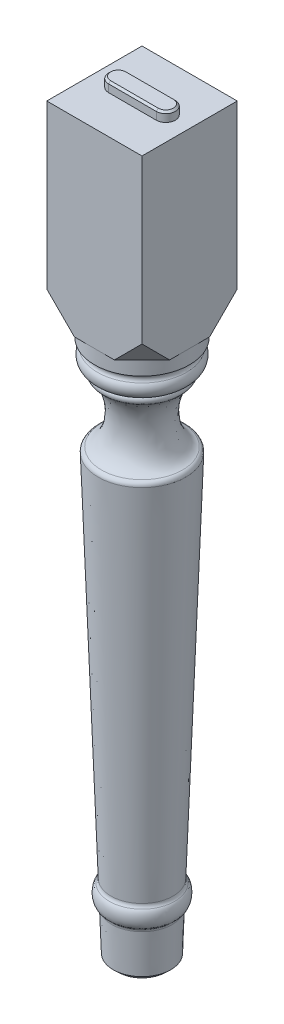
ISO-10303-21;
HEADER;
FILE_DESCRIPTION(('STEP AP214'),'2;1');
FILE_NAME('part.step','',(''),(''),'','','');
FILE_SCHEMA(('AUTOMOTIVE_DESIGN { 1 0 10303 214 1 1 1 1 }'));
ENDSEC;
DATA;
#1=APPLICATION_CONTEXT('core data for automotive mechanical design processes');
#2=APPLICATION_PROTOCOL_DEFINITION('international standard','automotive_design',2000,#1);
#3=PRODUCT_CONTEXT('',#1,'mechanical');
#4=PRODUCT('Part','Part','',(#3));
#5=PRODUCT_RELATED_PRODUCT_CATEGORY('part','',(#4));
#6=PRODUCT_DEFINITION_FORMATION('','',#4);
#7=PRODUCT_DEFINITION_CONTEXT('part definition',#1,'design');
#8=PRODUCT_DEFINITION('design','',#6,#7);
#9=PRODUCT_DEFINITION_SHAPE('','',#8);
#10=(LENGTH_UNIT() NAMED_UNIT(*) SI_UNIT(.MILLI.,.METRE.));
#11=(NAMED_UNIT(*) PLANE_ANGLE_UNIT() SI_UNIT($,.RADIAN.));
#12=(NAMED_UNIT(*) SI_UNIT($,.STERADIAN.) SOLID_ANGLE_UNIT());
#13=UNCERTAINTY_MEASURE_WITH_UNIT(LENGTH_MEASURE(1.E-05),#10,'distance_accuracy_value','');
#14=(GEOMETRIC_REPRESENTATION_CONTEXT(3) GLOBAL_UNCERTAINTY_ASSIGNED_CONTEXT((#13)) GLOBAL_UNIT_ASSIGNED_CONTEXT((#10,
#11,#12)) REPRESENTATION_CONTEXT('',''));
#15=CARTESIAN_POINT('',(0.,0.,0.));
#16=DIRECTION('',(0.,0.,1.));
#17=DIRECTION('',(1.,0.,0.));
#18=AXIS2_PLACEMENT_3D('',#15,#16,#17);
#19=CARTESIAN_POINT('',(0.,0.,0.));
#20=DIRECTION('',(0.,-1.,0.));
#21=DIRECTION('',(0.,0.,-1.));
#22=AXIS2_PLACEMENT_3D('',#19,#20,#21);
#23=PLANE('',#22);
#24=CARTESIAN_POINT('',(0.,0.,0.));
#25=DIRECTION('',(0.,-1.,0.));
#26=DIRECTION('',(0.,0.,-1.));
#27=AXIS2_PLACEMENT_3D('',#24,#25,#26);
#28=CIRCLE('',#27,24.8183506683762);
#29=CARTESIAN_POINT('',(0.,0.,-24.8183506683762));
#30=VERTEX_POINT('',#29);
#31=EDGE_CURVE('E308',#30,#30,#28,.T.);
#32=ORIENTED_EDGE('',*,*,#31,.T.);
#33=EDGE_LOOP('',(#32));
#34=FACE_BOUND('',#33,.T.);
#35=ADVANCED_FACE('F41',(#34),#23,.T.);
#36=CARTESIAN_POINT('',(0.,0.,0.));
#37=DIRECTION('',(0.,1.,0.));
#38=DIRECTION('',(0.,0.,1.));
#39=AXIS2_PLACEMENT_3D('',#36,#37,#38);
#40=CONICAL_SURFACE('',#39,30.,0.0344691009995081);
#41=CARTESIAN_POINT('',(0.,46.8280125464006,0.));
#42=DIRECTION('',(0.,1.,0.));
#43=DIRECTION('',(0.,0.,1.));
#44=AXIS2_PLACEMENT_3D('',#41,#42,#43);
#45=CIRCLE('',#44,31.6147590533242);
#46=CARTESIAN_POINT('',(0.,46.8280125464006,31.6147590533242));
#47=VERTEX_POINT('',#46);
#48=EDGE_CURVE('E293',#47,#47,#45,.F.);
#49=ORIENTED_EDGE('',*,*,#48,.T.);
#50=EDGE_LOOP('',(#49));
#51=FACE_BOUND('',#50,.T.);
#52=CARTESIAN_POINT('',(0.,4.99702999676788,0.));
#53=DIRECTION('',(0.,-1.,0.));
#54=DIRECTION('',(0.,0.,-1.));
#55=AXIS2_PLACEMENT_3D('',#52,#53,#54);
#56=CIRCLE('',#55,30.1723113791989);
#57=CARTESIAN_POINT('',(0.,4.99702999676788,-30.1723113791989));
#58=VERTEX_POINT('',#57);
#59=EDGE_CURVE('E305',#58,#58,#56,.F.);
#60=ORIENTED_EDGE('',*,*,#59,.T.);
#61=EDGE_LOOP('',(#60));
#62=FACE_BOUND('',#61,.T.);
#63=ADVANCED_FACE('F340',(#51,#62),#40,.T.);
#64=CARTESIAN_POINT('',(32.0689655172414,60.,0.));
#65=DIRECTION('',(0.,0.,1.));
#66=DIRECTION('',(0.0344622758397787,0.999405999353588,0.));
#67=AXIS2_PLACEMENT_3D('',#64,#65,#66);
#68=ELLIPSE('',#67,10.0059435369289,5.00297176846444);
#69=CARTESIAN_POINT('',(0.,0.,0.));
#70=DIRECTION('',(0.,-1.,0.));
#71=AXIS1_PLACEMENT('',#69,#70);
#72=SURFACE_OF_REVOLUTION('',#68,#71);
#73=CARTESIAN_POINT('',(0.,69.2136726827971,0.));
#74=DIRECTION('',(0.,-1.,0.));
#75=DIRECTION('',(0.,0.,-1.));
#76=AXIS2_PLACEMENT_3D('',#73,#74,#75);
#77=CIRCLE('',#76,34.2542904177695);
#78=CARTESIAN_POINT('',(0.,69.2136726827971,-34.2542904177695));
#79=VERTEX_POINT('',#78);
#80=EDGE_CURVE('E299',#79,#79,#77,.T.);
#81=ORIENTED_EDGE('',*,*,#80,.T.);
#82=EDGE_LOOP('',(#81));
#83=FACE_BOUND('',#82,.T.);
#84=CARTESIAN_POINT('',(0.,50.6576794563181,0.));
#85=DIRECTION('',(0.,-1.,0.));
#86=DIRECTION('',(0.,0.,-1.));
#87=AXIS2_PLACEMENT_3D('',#84,#85,#86);
#88=CIRCLE('',#87,33.6144285823737);
#89=CARTESIAN_POINT('',(0.,50.6576794563181,-33.6144285823737));
#90=VERTEX_POINT('',#89);
#91=EDGE_CURVE('E302',#90,#90,#88,.F.);
#92=ORIENTED_EDGE('',*,*,#91,.T.);
#93=EDGE_LOOP('',(#92));
#94=FACE_BOUND('',#93,.T.);
#95=ADVANCED_FACE('F336',(#83,#94),#72,.F.);
#96=CARTESIAN_POINT('',(0.,70.,0.));
#97=DIRECTION('',(0.,1.,0.));
#98=DIRECTION('',(0.,0.,1.));
#99=AXIS2_PLACEMENT_3D('',#96,#97,#98);
#100=CONICAL_SURFACE('',#99,32.4137931034483,0.0344691009995079);
#101=CARTESIAN_POINT('',(0.,460.773225628726,0.));
#102=DIRECTION('',(0.,-1.,0.));
#103=DIRECTION('',(0.,0.,-1.));
#104=AXIS2_PLACEMENT_3D('',#101,#102,#103);
#105=CIRCLE('',#104,45.8887319182319);
#106=CARTESIAN_POINT('',(0.,460.773225628726,-45.8887319182319));
#107=VERTEX_POINT('',#106);
#108=EDGE_CURVE('E287',#107,#107,#105,.T.);
#109=ORIENTED_EDGE('',*,*,#108,.T.);
#110=EDGE_LOOP('',(#109));
#111=FACE_BOUND('',#110,.T.);
#112=CARTESIAN_POINT('',(0.,73.1719874535994,0.));
#113=DIRECTION('',(0.,1.,0.));
#114=DIRECTION('',(0.,0.,1.));
#115=AXIS2_PLACEMENT_3D('',#112,#113,#114);
#116=CIRCLE('',#115,32.5231719811586);
#117=CARTESIAN_POINT('',(0.,73.1719874535994,32.5231719811586));
#118=VERTEX_POINT('',#117);
#119=EDGE_CURVE('E296',#118,#118,#116,.T.);
#120=ORIENTED_EDGE('',*,*,#119,.T.);
#121=EDGE_LOOP('',(#120));
#122=FACE_BOUND('',#121,.T.);
#123=ADVANCED_FACE('F331',(#111,#122),#100,.T.);
#124=CARTESIAN_POINT('',(47.2413793103448,500.,0.));
#125=DIRECTION('',(0.,0.,-1.));
#126=DIRECTION('',(-0.0344622758397788,-0.999405999353588,0.));
#127=AXIS2_PLACEMENT_3D('',#124,#125,#126);
#128=ELLIPSE('',#127,35.0208023792512,20.);
#129=CARTESIAN_POINT('',(0.,0.,0.));
#130=DIRECTION('',(0.,-1.,0.));
#131=AXIS1_PLACEMENT('',#129,#130);
#132=SURFACE_OF_REVOLUTION('',#128,#131);
#133=CARTESIAN_POINT('',(0.,465.664216401681,0.));
#134=DIRECTION('',(0.,-1.,0.));
#135=DIRECTION('',(0.,0.,-1.));
#136=AXIS2_PLACEMENT_3D('',#133,#134,#135);
#137=CIRCLE('',#136,42.5452026861877);
#138=CARTESIAN_POINT('',(0.,465.664216401681,-42.5452026861877));
#139=VERTEX_POINT('',#138);
#140=EDGE_CURVE('E284',#139,#139,#137,.F.);
#141=ORIENTED_EDGE('',*,*,#140,.T.);
#142=EDGE_LOOP('',(#141));
#143=FACE_BOUND('',#142,.T.);
#144=CARTESIAN_POINT('',(0.,531.799410173162,0.));
#145=DIRECTION('',(0.,-1.,0.));
#146=DIRECTION('',(0.,0.,-1.));
#147=AXIS2_PLACEMENT_3D('',#144,#145,#146);
#148=CIRCLE('',#147,39.6136701376359);
#149=CARTESIAN_POINT('',(0.,531.799410173162,-39.6136701376359));
#150=VERTEX_POINT('',#149);
#151=EDGE_CURVE('E290',#150,#150,#148,.T.);
#152=ORIENTED_EDGE('',*,*,#151,.T.);
#153=EDGE_LOOP('',(#152));
#154=FACE_BOUND('',#153,.T.);
#155=ADVANCED_FACE('F326',(#143,#154),#132,.F.);
#156=CARTESIAN_POINT('',(0.,550.,0.));
#157=DIRECTION('',(0.,-1.,0.));
#158=DIRECTION('',(0.,0.,-1.));
#159=AXIS2_PLACEMENT_3D('',#156,#157,#158);
#160=TOROIDAL_SURFACE('',#159,39.1003134648673,10.);
#161=CARTESIAN_POINT('',(0.,556.507985231847,0.));
#162=DIRECTION('',(0.,-1.,0.));
#163=DIRECTION('',(0.,0.,-1.));
#164=AXIS2_PLACEMENT_3D('',#161,#162,#163);
#165=CIRCLE('',#164,46.6928182045471);
#166=CARTESIAN_POINT('',(0.,556.507985231847,-46.6928182045471));
#167=VERTEX_POINT('',#166);
#168=EDGE_CURVE('E281',#167,#167,#165,.T.);
#169=ORIENTED_EDGE('',*,*,#168,.T.);
#170=EDGE_LOOP('',(#169));
#171=FACE_BOUND('',#170,.T.);
#172=CARTESIAN_POINT('',(0.,540.,0.));
#173=DIRECTION('',(0.,-1.,0.));
#174=DIRECTION('',(0.,0.,-1.));
#175=AXIS2_PLACEMENT_3D('',#172,#173,#174);
#176=CIRCLE('',#175,39.1003134648673);
#177=CARTESIAN_POINT('',(0.,540.,-39.1003134648673));
#178=VERTEX_POINT('',#177);
#179=EDGE_CURVE('E311',#178,#178,#176,.T.);
#180=ORIENTED_EDGE('',*,*,#179,.F.);
#181=EDGE_LOOP('',(#180));
#182=FACE_BOUND('',#181,.T.);
#183=ADVANCED_FACE('F330',(#171,#182),#160,.T.);
#184=CARTESIAN_POINT('',(0.,560.,0.));
#185=DIRECTION('',(0.,1.,0.));
#186=DIRECTION('',(0.,0.,1.));
#187=AXIS2_PLACEMENT_3D('',#184,#185,#186);
#188=CONICAL_SURFACE('',#187,39.1003134648673,1.1372815251714);
#189=CARTESIAN_POINT('',(0.,564.29945244737,0.));
#190=DIRECTION('',(0.,1.,0.));
#191=DIRECTION('',(0.,0.,1.));
#192=AXIS2_PLACEMENT_3D('',#189,#190,#191);
#193=CIRCLE('',#192,48.3887552985328);
#194=CARTESIAN_POINT('',(0.,564.29945244737,48.3887552985328));
#195=VERTEX_POINT('',#194);
#196=EDGE_CURVE('E278',#195,#195,#193,.T.);
#197=ORIENTED_EDGE('',*,*,#196,.T.);
#198=EDGE_LOOP('',(#197));
#199=FACE_BOUND('',#198,.T.);
#200=CARTESIAN_POINT('',(0.,565.,0.));
#201=DIRECTION('',(0.,-1.,0.));
#202=DIRECTION('',(0.,0.,-1.));
#203=AXIS2_PLACEMENT_3D('',#200,#201,#202);
#204=CIRCLE('',#203,49.9022027139811);
#205=CARTESIAN_POINT('',(0.,565.,-49.9022027139811));
#206=VERTEX_POINT('',#205);
#207=EDGE_CURVE('E314',#206,#206,#204,.T.);
#208=ORIENTED_EDGE('',*,*,#207,.T.);
#209=EDGE_LOOP('',(#208));
#210=FACE_BOUND('',#209,.T.);
#211=ADVANCED_FACE('F557',(#199,#210),#188,.T.);
#212=CARTESIAN_POINT('',(0.,565.,0.));
#213=DIRECTION('',(0.,1.,0.));
#214=DIRECTION('',(0.,0.,1.));
#215=AXIS2_PLACEMENT_3D('',#212,#213,#214);
#216=CONICAL_SURFACE('',#215,49.9022027139811,0.00651972668870377);
#217=CARTESIAN_POINT('',(0.,580.,0.));
#218=DIRECTION('',(0.,-1.,0.));
#219=DIRECTION('',(0.,0.,-1.));
#220=AXIS2_PLACEMENT_3D('',#217,#218,#219);
#221=CIRCLE('',#220,50.);
#222=CARTESIAN_POINT('',(0.,580.,-50.));
#223=VERTEX_POINT('',#222);
#224=CARTESIAN_POINT('',(50.,580.,0.));
#225=VERTEX_POINT('',#224);
#226=EDGE_CURVE('E317',#223,#225,#221,.T.);
#227=ORIENTED_EDGE('',*,*,#226,.T.);
#228=CARTESIAN_POINT('',(0.,580.,50.));
#229=VERTEX_POINT('',#228);
#230=EDGE_CURVE('E320',#225,#229,#221,.T.);
#231=ORIENTED_EDGE('',*,*,#230,.T.);
#232=CARTESIAN_POINT('',(-50.,580.,0.));
#233=VERTEX_POINT('',#232);
#234=EDGE_CURVE('E455',#229,#233,#221,.T.);
#235=ORIENTED_EDGE('',*,*,#234,.T.);
#236=EDGE_CURVE('E205',#233,#223,#221,.T.);
#237=ORIENTED_EDGE('',*,*,#236,.T.);
#238=EDGE_LOOP('',(#227,#231,#235,#237));
#239=FACE_BOUND('',#238,.T.);
#240=ORIENTED_EDGE('',*,*,#207,.F.);
#241=EDGE_LOOP('',(#240));
#242=FACE_BOUND('',#241,.T.);
#243=ADVANCED_FACE('F461',(#239,#242),#216,.T.);
#244=CARTESIAN_POINT('',(0.,580.,0.));
#245=DIRECTION('',(0.,1.,0.));
#246=DIRECTION('',(0.,0.,1.));
#247=AXIS2_PLACEMENT_3D('',#244,#245,#246);
#248=PLANE('',#247);
#249=DIRECTION('',(-0.707106781186548,0.,-0.707106781186548));
#250=VECTOR('',#249,1.);
#251=CARTESIAN_POINT('',(35.5,580.,-35.5));
#252=LINE('',#251,#250);
#253=CARTESIAN_POINT('',(50.,580.,-21.));
#254=VERTEX_POINT('',#253);
#255=CARTESIAN_POINT('',(21.,580.,-50.));
#256=VERTEX_POINT('',#255);
#257=EDGE_CURVE('E227',#254,#256,#252,.T.);
#258=ORIENTED_EDGE('',*,*,#257,.F.);
#259=DIRECTION('',(0.,0.,-1.));
#260=VECTOR('',#259,1.);
#261=CARTESIAN_POINT('',(50.,580.,-50.));
#262=LINE('',#261,#260);
#263=EDGE_CURVE('E425',#225,#254,#262,.T.);
#264=ORIENTED_EDGE('',*,*,#263,.F.);
#265=ORIENTED_EDGE('',*,*,#226,.F.);
#266=DIRECTION('',(-1.,0.,0.));
#267=VECTOR('',#266,1.);
#268=CARTESIAN_POINT('',(-50.,580.,-50.));
#269=LINE('',#268,#267);
#270=EDGE_CURVE('E445',#256,#223,#269,.T.);
#271=ORIENTED_EDGE('',*,*,#270,.F.);
#272=EDGE_LOOP('',(#258,#264,#265,#271));
#273=FACE_BOUND('',#272,.T.);
#274=ADVANCED_FACE('F472',(#273),#248,.F.);
#275=DIRECTION('',(0.707106781186548,0.,-0.707106781186548));
#276=VECTOR('',#275,1.);
#277=CARTESIAN_POINT('',(35.5,580.,35.5));
#278=LINE('',#277,#276);
#279=CARTESIAN_POINT('',(21.,580.,50.));
#280=VERTEX_POINT('',#279);
#281=CARTESIAN_POINT('',(50.,580.,21.0000000000001));
#282=VERTEX_POINT('',#281);
#283=EDGE_CURVE('E236',#280,#282,#278,.T.);
#284=ORIENTED_EDGE('',*,*,#283,.F.);
#285=DIRECTION('',(1.,0.,0.));
#286=VECTOR('',#285,1.);
#287=CARTESIAN_POINT('',(-50.,580.,50.));
#288=LINE('',#287,#286);
#289=EDGE_CURVE('E209',#229,#280,#288,.T.);
#290=ORIENTED_EDGE('',*,*,#289,.F.);
#291=ORIENTED_EDGE('',*,*,#230,.F.);
#292=EDGE_CURVE('E442',#282,#225,#262,.T.);
#293=ORIENTED_EDGE('',*,*,#292,.F.);
#294=EDGE_LOOP('',(#284,#290,#291,#293));
#295=FACE_BOUND('',#294,.T.);
#296=ADVANCED_FACE('F469',(#295),#248,.F.);
#297=DIRECTION('',(0.707106781186548,0.,0.707106781186547));
#298=VECTOR('',#297,1.);
#299=CARTESIAN_POINT('',(-35.5,580.,35.5));
#300=LINE('',#299,#298);
#301=CARTESIAN_POINT('',(-50.,580.,21.));
#302=VERTEX_POINT('',#301);
#303=CARTESIAN_POINT('',(-21.,580.,50.));
#304=VERTEX_POINT('',#303);
#305=EDGE_CURVE('E245',#302,#304,#300,.T.);
#306=ORIENTED_EDGE('',*,*,#305,.F.);
#307=DIRECTION('',(0.,0.,1.));
#308=VECTOR('',#307,1.);
#309=CARTESIAN_POINT('',(-50.,580.,-50.));
#310=LINE('',#309,#308);
#311=EDGE_CURVE('E210',#233,#302,#310,.T.);
#312=ORIENTED_EDGE('',*,*,#311,.F.);
#313=ORIENTED_EDGE('',*,*,#234,.F.);
#314=EDGE_CURVE('E435',#304,#229,#288,.T.);
#315=ORIENTED_EDGE('',*,*,#314,.F.);
#316=EDGE_LOOP('',(#306,#312,#313,#315));
#317=FACE_BOUND('',#316,.T.);
#318=ADVANCED_FACE('F548',(#317),#248,.F.);
#319=CARTESIAN_POINT('',(50.,780.,-50.));
#320=DIRECTION('',(-1.,0.,0.));
#321=DIRECTION('',(0.,0.,1.));
#322=AXIS2_PLACEMENT_3D('',#319,#320,#321);
#323=PLANE('',#322);
#324=DIRECTION('',(0.,-0.707106781186548,0.707106781186547));
#325=VECTOR('',#324,1.);
#326=CARTESIAN_POINT('',(50.,694.5,-135.5));
#327=LINE('',#326,#325);
#328=CARTESIAN_POINT('',(50.,609.,-50.));
#329=VERTEX_POINT('',#328);
#330=EDGE_CURVE('E222',#329,#254,#327,.T.);
#331=ORIENTED_EDGE('',*,*,#330,.F.);
#332=DIRECTION('',(0.,-1.,0.));
#333=VECTOR('',#332,1.);
#334=CARTESIAN_POINT('',(50.,780.,-50.));
#335=LINE('',#334,#333);
#336=CARTESIAN_POINT('',(50.,780.,-50.));
#337=VERTEX_POINT('',#336);
#338=EDGE_CURVE('E452',#337,#329,#335,.T.);
#339=ORIENTED_EDGE('',*,*,#338,.F.);
#340=DIRECTION('',(0.,0.,-1.));
#341=VECTOR('',#340,1.);
#342=CARTESIAN_POINT('',(50.,780.,-50.));
#343=LINE('',#342,#341);
#344=CARTESIAN_POINT('',(50.,780.,50.));
#345=VERTEX_POINT('',#344);
#346=EDGE_CURVE('E431',#345,#337,#343,.T.);
#347=ORIENTED_EDGE('',*,*,#346,.F.);
#348=DIRECTION('',(0.,-1.,0.));
#349=VECTOR('',#348,1.);
#350=CARTESIAN_POINT('',(50.,780.,50.));
#351=LINE('',#350,#349);
#352=CARTESIAN_POINT('',(50.,609.,50.));
#353=VERTEX_POINT('',#352);
#354=EDGE_CURVE('E441',#345,#353,#351,.T.);
#355=ORIENTED_EDGE('',*,*,#354,.T.);
#356=DIRECTION('',(0.,0.707106781186548,0.707106781186547));
#357=VECTOR('',#356,1.);
#358=CARTESIAN_POINT('',(50.,644.5,85.5000000000001));
#359=LINE('',#358,#357);
#360=EDGE_CURVE('E233',#282,#353,#359,.T.);
#361=ORIENTED_EDGE('',*,*,#360,.F.);
#362=ORIENTED_EDGE('',*,*,#292,.T.);
#363=ORIENTED_EDGE('',*,*,#263,.T.);
#364=EDGE_LOOP('',(#331,#339,#347,#355,#361,#362,#363));
#365=FACE_BOUND('',#364,.T.);
#366=ADVANCED_FACE('F475',(#365),#323,.F.);
#367=CARTESIAN_POINT('',(-50.,780.,-50.));
#368=DIRECTION('',(0.,0.,1.));
#369=DIRECTION('',(1.,0.,0.));
#370=AXIS2_PLACEMENT_3D('',#367,#368,#369);
#371=PLANE('',#370);
#372=DIRECTION('',(0.707106781186547,-0.707106781186548,0.));
#373=VECTOR('',#372,1.);
#374=CARTESIAN_POINT('',(-135.5,694.5,-50.));
#375=LINE('',#374,#373);
#376=CARTESIAN_POINT('',(-50.,609.,-50.));
#377=VERTEX_POINT('',#376);
#378=CARTESIAN_POINT('',(-20.9999999999998,580.,-50.));
#379=VERTEX_POINT('',#378);
#380=EDGE_CURVE('E57',#377,#379,#375,.T.);
#381=ORIENTED_EDGE('',*,*,#380,.F.);
#382=DIRECTION('',(0.,-1.,0.));
#383=VECTOR('',#382,1.);
#384=CARTESIAN_POINT('',(-50.,780.,-50.));
#385=LINE('',#384,#383);
#386=CARTESIAN_POINT('',(-50.,780.,-50.));
#387=VERTEX_POINT('',#386);
#388=EDGE_CURVE('E216',#387,#377,#385,.T.);
#389=ORIENTED_EDGE('',*,*,#388,.F.);
#390=DIRECTION('',(-1.,0.,0.));
#391=VECTOR('',#390,1.);
#392=CARTESIAN_POINT('',(-50.,780.,-50.));
#393=LINE('',#392,#391);
#394=EDGE_CURVE('E434',#337,#387,#393,.T.);
#395=ORIENTED_EDGE('',*,*,#394,.F.);
#396=ORIENTED_EDGE('',*,*,#338,.T.);
#397=DIRECTION('',(0.707106781186547,0.707106781186548,0.));
#398=VECTOR('',#397,1.);
#399=CARTESIAN_POINT('',(85.5,644.5,-50.));
#400=LINE('',#399,#398);
#401=EDGE_CURVE('E219',#256,#329,#400,.T.);
#402=ORIENTED_EDGE('',*,*,#401,.F.);
#403=ORIENTED_EDGE('',*,*,#270,.T.);
#404=EDGE_CURVE('E444',#223,#379,#269,.T.);
#405=ORIENTED_EDGE('',*,*,#404,.T.);
#406=EDGE_LOOP('',(#381,#389,#395,#396,#402,#403,#405));
#407=FACE_BOUND('',#406,.T.);
#408=DIRECTION('',(0.,-1.,0.));
#409=VECTOR('',#408,1.);
#410=CARTESIAN_POINT('',(6.00000000000001,765.,-50.));
#411=LINE('',#410,#409);
#412=CARTESIAN_POINT('',(6.00000000000001,765.,-50.));
#413=VERTEX_POINT('',#412);
#414=CARTESIAN_POINT('',(6.,745.,-50.));
#415=VERTEX_POINT('',#414);
#416=EDGE_CURVE('E486',#413,#415,#411,.T.);
#417=ORIENTED_EDGE('',*,*,#416,.F.);
#418=CARTESIAN_POINT('',(0.,765.,-50.));
#419=DIRECTION('',(0.,0.,-1.));
#420=DIRECTION('',(-1.,0.,0.));
#421=AXIS2_PLACEMENT_3D('',#418,#419,#420);
#422=CIRCLE('',#421,6.);
#423=CARTESIAN_POINT('',(-5.99999999999999,765.,-50.));
#424=VERTEX_POINT('',#423);
#425=EDGE_CURVE('E488',#424,#413,#422,.T.);
#426=ORIENTED_EDGE('',*,*,#425,.F.);
#427=DIRECTION('',(0.,1.,0.));
#428=VECTOR('',#427,1.);
#429=CARTESIAN_POINT('',(-5.99999999999999,765.,-50.));
#430=LINE('',#429,#428);
#431=CARTESIAN_POINT('',(-5.99999999999999,745.,-50.));
#432=VERTEX_POINT('',#431);
#433=EDGE_CURVE('E494',#432,#424,#430,.T.);
#434=ORIENTED_EDGE('',*,*,#433,.F.);
#435=CARTESIAN_POINT('',(0.,745.,-50.));
#436=DIRECTION('',(0.,0.,-1.));
#437=DIRECTION('',(-1.,0.,0.));
#438=AXIS2_PLACEMENT_3D('',#435,#436,#437);
#439=CIRCLE('',#438,6.);
#440=EDGE_CURVE('E490',#415,#432,#439,.T.);
#441=ORIENTED_EDGE('',*,*,#440,.F.);
#442=EDGE_LOOP('',(#417,#426,#434,#441));
#443=FACE_BOUND('',#442,.T.);
#444=ADVANCED_FACE('F478',(#407,#443),#371,.F.);
#445=CARTESIAN_POINT('',(-50.,780.,-50.));
#446=DIRECTION('',(1.,0.,0.));
#447=DIRECTION('',(0.,0.,-1.));
#448=AXIS2_PLACEMENT_3D('',#445,#446,#447);
#449=PLANE('',#448);
#450=DIRECTION('',(0.,0.707106781186548,-0.707106781186547));
#451=VECTOR('',#450,1.);
#452=CARTESIAN_POINT('',(-50.,694.5,-135.5));
#453=LINE('',#452,#451);
#454=CARTESIAN_POINT('',(-50.,580.,-20.9999999999998));
#455=VERTEX_POINT('',#454);
#456=EDGE_CURVE('E50',#455,#377,#453,.T.);
#457=ORIENTED_EDGE('',*,*,#456,.F.);
#458=EDGE_CURVE('E201',#455,#233,#310,.T.);
#459=ORIENTED_EDGE('',*,*,#458,.T.);
#460=ORIENTED_EDGE('',*,*,#311,.T.);
#461=DIRECTION('',(0.,-0.707106781186548,-0.707106781186547));
#462=VECTOR('',#461,1.);
#463=CARTESIAN_POINT('',(-50.,644.5,85.5000000000001));
#464=LINE('',#463,#462);
#465=CARTESIAN_POINT('',(-50.,609.,50.));
#466=VERTEX_POINT('',#465);
#467=EDGE_CURVE('E242',#466,#302,#464,.T.);
#468=ORIENTED_EDGE('',*,*,#467,.F.);
#469=DIRECTION('',(0.,-1.,0.));
#470=VECTOR('',#469,1.);
#471=CARTESIAN_POINT('',(-50.,780.,50.));
#472=LINE('',#471,#470);
#473=CARTESIAN_POINT('',(-50.,780.,50.));
#474=VERTEX_POINT('',#473);
#475=EDGE_CURVE('E450',#474,#466,#472,.T.);
#476=ORIENTED_EDGE('',*,*,#475,.F.);
#477=DIRECTION('',(0.,0.,1.));
#478=VECTOR('',#477,1.);
#479=CARTESIAN_POINT('',(-50.,780.,-50.));
#480=LINE('',#479,#478);
#481=EDGE_CURVE('E437',#387,#474,#480,.T.);
#482=ORIENTED_EDGE('',*,*,#481,.F.);
#483=ORIENTED_EDGE('',*,*,#388,.T.);
#484=EDGE_LOOP('',(#457,#459,#460,#468,#476,#482,#483));
#485=FACE_BOUND('',#484,.T.);
#486=DIRECTION('',(0.,-1.,0.));
#487=VECTOR('',#486,1.);
#488=CARTESIAN_POINT('',(-50.,765.,-6.));
#489=LINE('',#488,#487);
#490=CARTESIAN_POINT('',(-50.,765.,-5.99999999999999));
#491=VERTEX_POINT('',#490);
#492=CARTESIAN_POINT('',(-50.,745.,-5.99999999999999));
#493=VERTEX_POINT('',#492);
#494=EDGE_CURVE('E835',#491,#493,#489,.T.);
#495=ORIENTED_EDGE('',*,*,#494,.F.);
#496=CARTESIAN_POINT('',(-50.,765.,0.));
#497=DIRECTION('',(-1.,0.,0.));
#498=DIRECTION('',(0.,0.,1.));
#499=AXIS2_PLACEMENT_3D('',#496,#497,#498);
#500=CIRCLE('',#499,6.);
#501=CARTESIAN_POINT('',(-50.,765.,6.));
#502=VERTEX_POINT('',#501);
#503=EDGE_CURVE('E838',#502,#491,#500,.T.);
#504=ORIENTED_EDGE('',*,*,#503,.F.);
#505=DIRECTION('',(0.,1.,0.));
#506=VECTOR('',#505,1.);
#507=CARTESIAN_POINT('',(-50.,765.,6.));
#508=LINE('',#507,#506);
#509=CARTESIAN_POINT('',(-50.,745.,6.00000000000001));
#510=VERTEX_POINT('',#509);
#511=EDGE_CURVE('E828',#510,#502,#508,.T.);
#512=ORIENTED_EDGE('',*,*,#511,.F.);
#513=CARTESIAN_POINT('',(-50.,745.,0.));
#514=DIRECTION('',(-1.,0.,0.));
#515=DIRECTION('',(0.,0.,1.));
#516=AXIS2_PLACEMENT_3D('',#513,#514,#515);
#517=CIRCLE('',#516,6.);
#518=EDGE_CURVE('E832',#493,#510,#517,.T.);
#519=ORIENTED_EDGE('',*,*,#518,.F.);
#520=EDGE_LOOP('',(#495,#504,#512,#519));
#521=FACE_BOUND('',#520,.T.);
#522=ADVANCED_FACE('F213',(#485,#521),#449,.F.);
#523=CARTESIAN_POINT('',(-50.,780.,50.));
#524=DIRECTION('',(0.,0.,-1.));
#525=DIRECTION('',(-1.,0.,0.));
#526=AXIS2_PLACEMENT_3D('',#523,#524,#525);
#527=PLANE('',#526);
#528=DIRECTION('',(-0.707106781186547,-0.707106781186548,0.));
#529=VECTOR('',#528,1.);
#530=CARTESIAN_POINT('',(85.5000000000001,644.5,50.));
#531=LINE('',#530,#529);
#532=EDGE_CURVE('E230',#353,#280,#531,.T.);
#533=ORIENTED_EDGE('',*,*,#532,.F.);
#534=ORIENTED_EDGE('',*,*,#354,.F.);
#535=DIRECTION('',(1.,0.,0.));
#536=VECTOR('',#535,1.);
#537=CARTESIAN_POINT('',(-50.,780.,50.));
#538=LINE('',#537,#536);
#539=EDGE_CURVE('E439',#474,#345,#538,.T.);
#540=ORIENTED_EDGE('',*,*,#539,.F.);
#541=ORIENTED_EDGE('',*,*,#475,.T.);
#542=DIRECTION('',(-0.707106781186547,0.707106781186548,0.));
#543=VECTOR('',#542,1.);
#544=CARTESIAN_POINT('',(-135.5,694.5,50.));
#545=LINE('',#544,#543);
#546=EDGE_CURVE('E239',#304,#466,#545,.T.);
#547=ORIENTED_EDGE('',*,*,#546,.F.);
#548=ORIENTED_EDGE('',*,*,#314,.T.);
#549=ORIENTED_EDGE('',*,*,#289,.T.);
#550=EDGE_LOOP('',(#533,#534,#540,#541,#547,#548,#549));
#551=FACE_BOUND('',#550,.T.);
#552=ADVANCED_FACE('F545',(#551),#527,.F.);
#553=CARTESIAN_POINT('',(0.,780.,0.));
#554=DIRECTION('',(0.,1.,0.));
#555=DIRECTION('',(0.,0.,1.));
#556=AXIS2_PLACEMENT_3D('',#553,#554,#555);
#557=PLANE('',#556);
#558=CARTESIAN_POINT('',(-25.,780.,0.));
#559=DIRECTION('',(0.,1.,0.));
#560=DIRECTION('',(0.,0.,1.));
#561=AXIS2_PLACEMENT_3D('',#558,#559,#560);
#562=CIRCLE('',#561,10.);
#563=CARTESIAN_POINT('',(-25.,780.,-10.));
#564=VERTEX_POINT('',#563);
#565=CARTESIAN_POINT('',(-25.,780.,10.));
#566=VERTEX_POINT('',#565);
#567=EDGE_CURVE('E252',#564,#566,#562,.T.);
#568=ORIENTED_EDGE('',*,*,#567,.F.);
#569=DIRECTION('',(-1.,0.,0.));
#570=VECTOR('',#569,1.);
#571=CARTESIAN_POINT('',(-25.,780.,-10.));
#572=LINE('',#571,#570);
#573=CARTESIAN_POINT('',(25.,780.,-10.));
#574=VERTEX_POINT('',#573);
#575=EDGE_CURVE('E516',#574,#564,#572,.T.);
#576=ORIENTED_EDGE('',*,*,#575,.F.);
#577=CARTESIAN_POINT('',(25.,780.,0.));
#578=DIRECTION('',(0.,1.,0.));
#579=DIRECTION('',(0.,0.,1.));
#580=AXIS2_PLACEMENT_3D('',#577,#578,#579);
#581=CIRCLE('',#580,10.);
#582=CARTESIAN_POINT('',(25.,780.,10.));
#583=VERTEX_POINT('',#582);
#584=EDGE_CURVE('E514',#583,#574,#581,.T.);
#585=ORIENTED_EDGE('',*,*,#584,.F.);
#586=DIRECTION('',(1.,0.,0.));
#587=VECTOR('',#586,1.);
#588=CARTESIAN_POINT('',(-25.,780.,10.));
#589=LINE('',#588,#587);
#590=EDGE_CURVE('E422',#566,#583,#589,.T.);
#591=ORIENTED_EDGE('',*,*,#590,.F.);
#592=EDGE_LOOP('',(#568,#576,#585,#591));
#593=FACE_BOUND('',#592,.T.);
#594=ORIENTED_EDGE('',*,*,#346,.T.);
#595=ORIENTED_EDGE('',*,*,#394,.T.);
#596=ORIENTED_EDGE('',*,*,#481,.T.);
#597=ORIENTED_EDGE('',*,*,#539,.T.);
#598=EDGE_LOOP('',(#594,#595,#596,#597));
#599=FACE_BOUND('',#598,.T.);
#600=ADVANCED_FACE('F525',(#593,#599),#557,.T.);
#601=DIRECTION('',(-0.707106781186547,0.,0.707106781186548));
#602=VECTOR('',#601,1.);
#603=CARTESIAN_POINT('',(-35.4999999999999,580.,-35.4999999999999));
#604=LINE('',#603,#602);
#605=EDGE_CURVE('E11',#379,#455,#604,.T.);
#606=ORIENTED_EDGE('',*,*,#605,.F.);
#607=ORIENTED_EDGE('',*,*,#404,.F.);
#608=ORIENTED_EDGE('',*,*,#236,.F.);
#609=ORIENTED_EDGE('',*,*,#458,.F.);
#610=EDGE_LOOP('',(#606,#607,#608,#609));
#611=FACE_BOUND('',#610,.T.);
#612=ADVANCED_FACE('F203',(#611),#248,.F.);
#613=CARTESIAN_POINT('',(0.,0.,0.));
#614=DIRECTION('',(0.,1.,0.));
#615=DIRECTION('',(0.,0.,1.));
#616=AXIS2_PLACEMENT_3D('',#613,#614,#615);
#617=CONICAL_SURFACE('',#616,24.8183506683762,0.819867264396957);
#618=ORIENTED_EDGE('',*,*,#59,.F.);
#619=EDGE_LOOP('',(#618));
#620=FACE_BOUND('',#619,.T.);
#621=ORIENTED_EDGE('',*,*,#31,.F.);
#622=EDGE_LOOP('',(#621));
#623=FACE_BOUND('',#622,.T.);
#624=ADVANCED_FACE('F349',(#620,#623),#617,.T.);
#625=CARTESIAN_POINT('',(0.,72.9996760744005,0.));
#626=DIRECTION('',(0.,-1.,0.));
#627=DIRECTION('',(0.,0.,-1.));
#628=AXIS2_PLACEMENT_3D('',#625,#626,#627);
#629=TOROIDAL_SURFACE('',#628,37.5202019779265,5.);
#630=ORIENTED_EDGE('',*,*,#119,.F.);
#631=EDGE_LOOP('',(#630));
#632=FACE_BOUND('',#631,.T.);
#633=ORIENTED_EDGE('',*,*,#80,.F.);
#634=EDGE_LOOP('',(#633));
#635=FACE_BOUND('',#634,.T.);
#636=ADVANCED_FACE('F354',(#632,#635),#629,.F.);
#637=CARTESIAN_POINT('',(0.,46.6557011672017,0.));
#638=DIRECTION('',(0.,-1.,0.));
#639=DIRECTION('',(0.,0.,-1.));
#640=AXIS2_PLACEMENT_3D('',#637,#638,#639);
#641=TOROIDAL_SURFACE('',#640,36.6117890500921,5.);
#642=ORIENTED_EDGE('',*,*,#91,.F.);
#643=EDGE_LOOP('',(#642));
#644=FACE_BOUND('',#643,.T.);
#645=ORIENTED_EDGE('',*,*,#48,.F.);
#646=EDGE_LOOP('',(#645));
#647=FACE_BOUND('',#646,.T.);
#648=ADVANCED_FACE('F358',(#644,#647),#641,.F.);
#649=CARTESIAN_POINT('',(0.,535.721652514531,0.));
#650=DIRECTION('',(0.,-1.,0.));
#651=DIRECTION('',(0.,0.,-1.));
#652=AXIS2_PLACEMENT_3D('',#649,#650,#651);
#653=TOROIDAL_SURFACE('',#652,36.5127001255952,5.);
#654=ORIENTED_EDGE('',*,*,#179,.T.);
#655=EDGE_LOOP('',(#654));
#656=FACE_BOUND('',#655,.T.);
#657=ORIENTED_EDGE('',*,*,#151,.F.);
#658=EDGE_LOOP('',(#657));
#659=FACE_BOUND('',#658,.T.);
#660=ADVANCED_FACE('F362',(#656,#659),#653,.T.);
#661=CARTESIAN_POINT('',(0.,460.945537007924,0.));
#662=DIRECTION('',(0.,1.,0.));
#663=DIRECTION('',(0.,0.,1.));
#664=AXIS2_PLACEMENT_3D('',#661,#662,#663);
#665=TOROIDAL_SURFACE('',#664,40.8917019214639,5.);
#666=ORIENTED_EDGE('',*,*,#140,.F.);
#667=EDGE_LOOP('',(#666));
#668=FACE_BOUND('',#667,.T.);
#669=ORIENTED_EDGE('',*,*,#108,.F.);
#670=EDGE_LOOP('',(#669));
#671=FACE_BOUND('',#670,.T.);
#672=ADVANCED_FACE('F366',(#668,#671),#665,.T.);
#673=CARTESIAN_POINT('',(0.,559.761977847771,0.));
#674=DIRECTION('',(0.,-1.,0.));
#675=DIRECTION('',(0.,0.,-1.));
#676=AXIS2_PLACEMENT_3D('',#673,#674,#675);
#677=TOROIDAL_SURFACE('',#676,50.489070574387,5.);
#678=ORIENTED_EDGE('',*,*,#196,.F.);
#679=EDGE_LOOP('',(#678));
#680=FACE_BOUND('',#679,.T.);
#681=ORIENTED_EDGE('',*,*,#168,.F.);
#682=EDGE_LOOP('',(#681));
#683=FACE_BOUND('',#682,.T.);
#684=ADVANCED_FACE('F370',(#680,#683),#677,.F.);
#685=CARTESIAN_POINT('',(-25.,790.,0.));
#686=DIRECTION('',(0.,-1.,0.));
#687=DIRECTION('',(0.,0.,-1.));
#688=AXIS2_PLACEMENT_3D('',#685,#686,#687);
#689=CYLINDRICAL_SURFACE('',#688,10.);
#690=DIRECTION('',(0.,-1.,0.));
#691=VECTOR('',#690,1.);
#692=CARTESIAN_POINT('',(-25.,790.,10.));
#693=LINE('',#692,#691);
#694=CARTESIAN_POINT('',(-25.,788.,10.));
#695=VERTEX_POINT('',#694);
#696=EDGE_CURVE('E423',#695,#566,#693,.T.);
#697=ORIENTED_EDGE('',*,*,#696,.F.);
#698=CARTESIAN_POINT('',(-25.,788.,0.));
#699=DIRECTION('',(0.,1.,0.));
#700=DIRECTION('',(0.,0.,1.));
#701=AXIS2_PLACEMENT_3D('',#698,#699,#700);
#702=CIRCLE('',#701,10.);
#703=CARTESIAN_POINT('',(-25.,788.,-10.));
#704=VERTEX_POINT('',#703);
#705=EDGE_CURVE('E266',#695,#704,#702,.F.);
#706=ORIENTED_EDGE('',*,*,#705,.T.);
#707=DIRECTION('',(0.,-1.,0.));
#708=VECTOR('',#707,1.);
#709=CARTESIAN_POINT('',(-25.,790.,-10.));
#710=LINE('',#709,#708);
#711=EDGE_CURVE('E427',#704,#564,#710,.T.);
#712=ORIENTED_EDGE('',*,*,#711,.T.);
#713=ORIENTED_EDGE('',*,*,#567,.T.);
#714=EDGE_LOOP('',(#697,#706,#712,#713));
#715=FACE_BOUND('',#714,.T.);
#716=ADVANCED_FACE('F374',(#715),#689,.T.);
#717=CARTESIAN_POINT('',(-25.,790.,10.));
#718=DIRECTION('',(0.,0.,-1.));
#719=DIRECTION('',(-1.,0.,0.));
#720=AXIS2_PLACEMENT_3D('',#717,#718,#719);
#721=PLANE('',#720);
#722=DIRECTION('',(0.,-1.,0.));
#723=VECTOR('',#722,1.);
#724=CARTESIAN_POINT('',(25.,790.,10.));
#725=LINE('',#724,#723);
#726=CARTESIAN_POINT('',(25.,788.,10.));
#727=VERTEX_POINT('',#726);
#728=EDGE_CURVE('E414',#727,#583,#725,.T.);
#729=ORIENTED_EDGE('',*,*,#728,.F.);
#730=DIRECTION('',(-1.,0.,0.));
#731=VECTOR('',#730,1.);
#732=CARTESIAN_POINT('',(-25.,788.,10.));
#733=LINE('',#732,#731);
#734=EDGE_CURVE('E264',#727,#695,#733,.T.);
#735=ORIENTED_EDGE('',*,*,#734,.T.);
#736=ORIENTED_EDGE('',*,*,#696,.T.);
#737=ORIENTED_EDGE('',*,*,#590,.T.);
#738=EDGE_LOOP('',(#729,#735,#736,#737));
#739=FACE_BOUND('',#738,.T.);
#740=ADVANCED_FACE('F419',(#739),#721,.F.);
#741=CARTESIAN_POINT('',(25.,790.,0.));
#742=DIRECTION('',(0.,-1.,0.));
#743=DIRECTION('',(0.,0.,-1.));
#744=AXIS2_PLACEMENT_3D('',#741,#742,#743);
#745=CYLINDRICAL_SURFACE('',#744,10.);
#746=DIRECTION('',(0.,-1.,0.));
#747=VECTOR('',#746,1.);
#748=CARTESIAN_POINT('',(25.,790.,-10.));
#749=LINE('',#748,#747);
#750=CARTESIAN_POINT('',(25.,788.,-10.));
#751=VERTEX_POINT('',#750);
#752=EDGE_CURVE('E416',#751,#574,#749,.T.);
#753=ORIENTED_EDGE('',*,*,#752,.F.);
#754=CARTESIAN_POINT('',(25.,788.,0.));
#755=DIRECTION('',(0.,1.,0.));
#756=DIRECTION('',(0.,0.,1.));
#757=AXIS2_PLACEMENT_3D('',#754,#755,#756);
#758=CIRCLE('',#757,10.);
#759=EDGE_CURVE('E248',#751,#727,#758,.F.);
#760=ORIENTED_EDGE('',*,*,#759,.T.);
#761=ORIENTED_EDGE('',*,*,#728,.T.);
#762=ORIENTED_EDGE('',*,*,#584,.T.);
#763=EDGE_LOOP('',(#753,#760,#761,#762));
#764=FACE_BOUND('',#763,.T.);
#765=ADVANCED_FACE('F412',(#764),#745,.T.);
#766=CARTESIAN_POINT('',(-25.,790.,-10.));
#767=DIRECTION('',(0.,0.,1.));
#768=DIRECTION('',(1.,0.,0.));
#769=AXIS2_PLACEMENT_3D('',#766,#767,#768);
#770=PLANE('',#769);
#771=ORIENTED_EDGE('',*,*,#711,.F.);
#772=DIRECTION('',(1.,0.,0.));
#773=VECTOR('',#772,1.);
#774=CARTESIAN_POINT('',(25.,788.,-10.));
#775=LINE('',#774,#773);
#776=EDGE_CURVE('E262',#704,#751,#775,.T.);
#777=ORIENTED_EDGE('',*,*,#776,.T.);
#778=ORIENTED_EDGE('',*,*,#752,.T.);
#779=ORIENTED_EDGE('',*,*,#575,.T.);
#780=EDGE_LOOP('',(#771,#777,#778,#779));
#781=FACE_BOUND('',#780,.T.);
#782=ADVANCED_FACE('F527',(#781),#770,.F.);
#783=CARTESIAN_POINT('',(-25.,790.,0.));
#784=DIRECTION('',(0.,1.,0.));
#785=DIRECTION('',(0.,0.,1.));
#786=AXIS2_PLACEMENT_3D('',#783,#784,#785);
#787=PLANE('',#786);
#788=DIRECTION('',(-1.,0.,0.));
#789=VECTOR('',#788,1.);
#790=CARTESIAN_POINT('',(-25.,790.,-8.00000000000012));
#791=LINE('',#790,#789);
#792=CARTESIAN_POINT('',(25.,790.,-8.00000000000013));
#793=VERTEX_POINT('',#792);
#794=CARTESIAN_POINT('',(-25.,790.,-8.00000000000012));
#795=VERTEX_POINT('',#794);
#796=EDGE_CURVE('E274',#793,#795,#791,.T.);
#797=ORIENTED_EDGE('',*,*,#796,.T.);
#798=CARTESIAN_POINT('',(-25.,790.,0.));
#799=DIRECTION('',(0.,1.,0.));
#800=DIRECTION('',(0.,0.,1.));
#801=AXIS2_PLACEMENT_3D('',#798,#799,#800);
#802=CIRCLE('',#801,8.00000000000012);
#803=CARTESIAN_POINT('',(-25.,790.,8.00000000000012));
#804=VERTEX_POINT('',#803);
#805=EDGE_CURVE('E269',#795,#804,#802,.T.);
#806=ORIENTED_EDGE('',*,*,#805,.T.);
#807=DIRECTION('',(1.,0.,0.));
#808=VECTOR('',#807,1.);
#809=CARTESIAN_POINT('',(25.,790.,8.00000000000011));
#810=LINE('',#809,#808);
#811=CARTESIAN_POINT('',(25.,790.,8.00000000000011));
#812=VERTEX_POINT('',#811);
#813=EDGE_CURVE('E272',#804,#812,#810,.T.);
#814=ORIENTED_EDGE('',*,*,#813,.T.);
#815=CARTESIAN_POINT('',(25.,790.,0.));
#816=DIRECTION('',(0.,1.,0.));
#817=DIRECTION('',(0.,0.,1.));
#818=AXIS2_PLACEMENT_3D('',#815,#816,#817);
#819=CIRCLE('',#818,8.00000000000012);
#820=EDGE_CURVE('E276',#812,#793,#819,.T.);
#821=ORIENTED_EDGE('',*,*,#820,.T.);
#822=EDGE_LOOP('',(#797,#806,#814,#821));
#823=FACE_BOUND('',#822,.T.);
#824=ADVANCED_FACE('F399',(#823),#787,.T.);
#825=CARTESIAN_POINT('',(25.,790.,0.));
#826=DIRECTION('',(0.,-1.,0.));
#827=DIRECTION('',(0.,0.,-1.));
#828=AXIS2_PLACEMENT_3D('',#825,#826,#827);
#829=CONICAL_SURFACE('',#828,8.00000000000012,0.785398163397448);
#830=DIRECTION('',(0.,0.707106781186547,-0.707106781186547));
#831=VECTOR('',#830,1.);
#832=CARTESIAN_POINT('',(25.,788.,10.));
#833=LINE('',#832,#831);
#834=EDGE_CURVE('E253',#727,#812,#833,.T.);
#835=ORIENTED_EDGE('',*,*,#834,.F.);
#836=ORIENTED_EDGE('',*,*,#759,.F.);
#837=DIRECTION('',(0.,-0.707106781186547,-0.707106781186547));
#838=VECTOR('',#837,1.);
#839=CARTESIAN_POINT('',(25.,790.,-8.00000000000013));
#840=LINE('',#839,#838);
#841=EDGE_CURVE('E249',#793,#751,#840,.T.);
#842=ORIENTED_EDGE('',*,*,#841,.F.);
#843=ORIENTED_EDGE('',*,*,#820,.F.);
#844=EDGE_LOOP('',(#835,#836,#842,#843));
#845=FACE_BOUND('',#844,.T.);
#846=ADVANCED_FACE('F44',(#845),#829,.T.);
#847=CARTESIAN_POINT('',(-25.,790.,-8.00000000000012));
#848=DIRECTION('',(0.,0.707106781186547,-0.707106781186547));
#849=DIRECTION('',(1.,0.,0.));
#850=AXIS2_PLACEMENT_3D('',#847,#848,#849);
#851=PLANE('',#850);
#852=ORIENTED_EDGE('',*,*,#841,.T.);
#853=ORIENTED_EDGE('',*,*,#776,.F.);
#854=DIRECTION('',(0.,-0.707106781186547,-0.707106781186547));
#855=VECTOR('',#854,1.);
#856=CARTESIAN_POINT('',(-25.,790.,-8.00000000000012));
#857=LINE('',#856,#855);
#858=EDGE_CURVE('E256',#795,#704,#857,.T.);
#859=ORIENTED_EDGE('',*,*,#858,.F.);
#860=ORIENTED_EDGE('',*,*,#796,.F.);
#861=EDGE_LOOP('',(#852,#853,#859,#860));
#862=FACE_BOUND('',#861,.T.);
#863=ADVANCED_FACE('F390',(#862),#851,.T.);
#864=CARTESIAN_POINT('',(-25.,790.,8.00000000000012));
#865=DIRECTION('',(0.,0.707106781186547,0.707106781186547));
#866=DIRECTION('',(-1.,0.,0.));
#867=AXIS2_PLACEMENT_3D('',#864,#865,#866);
#868=PLANE('',#867);
#869=ORIENTED_EDGE('',*,*,#834,.T.);
#870=ORIENTED_EDGE('',*,*,#813,.F.);
#871=DIRECTION('',(0.,0.707106781186547,-0.707106781186547));
#872=VECTOR('',#871,1.);
#873=CARTESIAN_POINT('',(-25.,788.,10.));
#874=LINE('',#873,#872);
#875=EDGE_CURVE('E258',#695,#804,#874,.T.);
#876=ORIENTED_EDGE('',*,*,#875,.F.);
#877=ORIENTED_EDGE('',*,*,#734,.F.);
#878=EDGE_LOOP('',(#869,#870,#876,#877));
#879=FACE_BOUND('',#878,.T.);
#880=ADVANCED_FACE('F384',(#879),#868,.T.);
#881=CARTESIAN_POINT('',(-25.,790.,0.));
#882=DIRECTION('',(0.,-1.,0.));
#883=DIRECTION('',(0.,0.,-1.));
#884=AXIS2_PLACEMENT_3D('',#881,#882,#883);
#885=CONICAL_SURFACE('',#884,8.00000000000012,0.785398163397448);
#886=ORIENTED_EDGE('',*,*,#858,.T.);
#887=ORIENTED_EDGE('',*,*,#705,.F.);
#888=ORIENTED_EDGE('',*,*,#875,.T.);
#889=ORIENTED_EDGE('',*,*,#805,.F.);
#890=EDGE_LOOP('',(#886,#887,#888,#889));
#891=FACE_BOUND('',#890,.T.);
#892=ADVANCED_FACE('F377',(#891),#885,.T.);
#893=CARTESIAN_POINT('',(0.,765.,-35.));
#894=DIRECTION('',(0.,0.,-1.));
#895=DIRECTION('',(-1.,0.,0.));
#896=AXIS2_PLACEMENT_3D('',#893,#894,#895);
#897=CYLINDRICAL_SURFACE('',#896,6.);
#898=ORIENTED_EDGE('',*,*,#425,.T.);
#899=DIRECTION('',(0.,0.,-1.));
#900=VECTOR('',#899,1.);
#901=CARTESIAN_POINT('',(6.00000000000001,765.,-35.));
#902=LINE('',#901,#900);
#903=CARTESIAN_POINT('',(6.00000000000001,765.,-35.));
#904=VERTEX_POINT('',#903);
#905=EDGE_CURVE('E508',#904,#413,#902,.T.);
#906=ORIENTED_EDGE('',*,*,#905,.F.);
#907=CARTESIAN_POINT('',(0.,765.,-35.));
#908=DIRECTION('',(0.,0.,-1.));
#909=DIRECTION('',(-1.,0.,0.));
#910=AXIS2_PLACEMENT_3D('',#907,#908,#909);
#911=CIRCLE('',#910,6.);
#912=CARTESIAN_POINT('',(-5.99999999999999,765.,-35.));
#913=VERTEX_POINT('',#912);
#914=EDGE_CURVE('E502',#913,#904,#911,.T.);
#915=ORIENTED_EDGE('',*,*,#914,.F.);
#916=DIRECTION('',(0.,0.,-1.));
#917=VECTOR('',#916,1.);
#918=CARTESIAN_POINT('',(-5.99999999999999,765.,-35.));
#919=LINE('',#918,#917);
#920=EDGE_CURVE('E260',#913,#424,#919,.T.);
#921=ORIENTED_EDGE('',*,*,#920,.T.);
#922=EDGE_LOOP('',(#898,#906,#915,#921));
#923=FACE_BOUND('',#922,.T.);
#924=ADVANCED_FACE('F383',(#923),#897,.F.);
#925=CARTESIAN_POINT('',(-5.99999999999999,765.,-35.));
#926=DIRECTION('',(-1.,0.,0.));
#927=DIRECTION('',(0.,-1.,0.));
#928=AXIS2_PLACEMENT_3D('',#925,#926,#927);
#929=PLANE('',#928);
#930=ORIENTED_EDGE('',*,*,#433,.T.);
#931=ORIENTED_EDGE('',*,*,#920,.F.);
#932=DIRECTION('',(0.,1.,0.));
#933=VECTOR('',#932,1.);
#934=CARTESIAN_POINT('',(-5.99999999999999,765.,-35.));
#935=LINE('',#934,#933);
#936=CARTESIAN_POINT('',(-5.99999999999999,745.,-35.));
#937=VERTEX_POINT('',#936);
#938=EDGE_CURVE('E510',#937,#913,#935,.T.);
#939=ORIENTED_EDGE('',*,*,#938,.F.);
#940=DIRECTION('',(0.,0.,-1.));
#941=VECTOR('',#940,1.);
#942=CARTESIAN_POINT('',(-5.99999999999999,745.,-35.));
#943=LINE('',#942,#941);
#944=EDGE_CURVE('E504',#937,#432,#943,.T.);
#945=ORIENTED_EDGE('',*,*,#944,.T.);
#946=EDGE_LOOP('',(#930,#931,#939,#945));
#947=FACE_BOUND('',#946,.T.);
#948=ADVANCED_FACE('F754',(#947),#929,.F.);
#949=CARTESIAN_POINT('',(0.,745.,-35.));
#950=DIRECTION('',(0.,0.,-1.));
#951=DIRECTION('',(-1.,0.,0.));
#952=AXIS2_PLACEMENT_3D('',#949,#950,#951);
#953=CYLINDRICAL_SURFACE('',#952,6.);
#954=ORIENTED_EDGE('',*,*,#440,.T.);
#955=ORIENTED_EDGE('',*,*,#944,.F.);
#956=CARTESIAN_POINT('',(0.,745.,-35.));
#957=DIRECTION('',(0.,0.,-1.));
#958=DIRECTION('',(-1.,0.,0.));
#959=AXIS2_PLACEMENT_3D('',#956,#957,#958);
#960=CIRCLE('',#959,6.);
#961=CARTESIAN_POINT('',(6.,745.,-35.));
#962=VERTEX_POINT('',#961);
#963=EDGE_CURVE('E812',#962,#937,#960,.T.);
#964=ORIENTED_EDGE('',*,*,#963,.F.);
#965=DIRECTION('',(0.,0.,-1.));
#966=VECTOR('',#965,1.);
#967=CARTESIAN_POINT('',(6.,745.,-35.));
#968=LINE('',#967,#966);
#969=EDGE_CURVE('E506',#962,#415,#968,.T.);
#970=ORIENTED_EDGE('',*,*,#969,.T.);
#971=EDGE_LOOP('',(#954,#955,#964,#970));
#972=FACE_BOUND('',#971,.T.);
#973=ADVANCED_FACE('F747',(#972),#953,.F.);
#974=CARTESIAN_POINT('',(6.00000000000001,765.,-35.));
#975=DIRECTION('',(1.,0.,0.));
#976=DIRECTION('',(0.,1.,0.));
#977=AXIS2_PLACEMENT_3D('',#974,#975,#976);
#978=PLANE('',#977);
#979=ORIENTED_EDGE('',*,*,#416,.T.);
#980=ORIENTED_EDGE('',*,*,#969,.F.);
#981=DIRECTION('',(0.,-1.,0.));
#982=VECTOR('',#981,1.);
#983=CARTESIAN_POINT('',(6.00000000000001,765.,-35.));
#984=LINE('',#983,#982);
#985=EDGE_CURVE('E808',#904,#962,#984,.T.);
#986=ORIENTED_EDGE('',*,*,#985,.F.);
#987=ORIENTED_EDGE('',*,*,#905,.T.);
#988=EDGE_LOOP('',(#979,#980,#986,#987));
#989=FACE_BOUND('',#988,.T.);
#990=ADVANCED_FACE('F739',(#989),#978,.F.);
#991=CARTESIAN_POINT('',(0.,765.,-35.));
#992=DIRECTION('',(0.,0.,-1.));
#993=DIRECTION('',(-1.,0.,0.));
#994=AXIS2_PLACEMENT_3D('',#991,#992,#993);
#995=PLANE('',#994);
#996=ORIENTED_EDGE('',*,*,#914,.T.);
#997=ORIENTED_EDGE('',*,*,#985,.T.);
#998=ORIENTED_EDGE('',*,*,#963,.T.);
#999=ORIENTED_EDGE('',*,*,#938,.T.);
#1000=EDGE_LOOP('',(#996,#997,#998,#999));
#1001=FACE_BOUND('',#1000,.T.);
#1002=ADVANCED_FACE('F731',(#1001),#995,.T.);
#1003=CARTESIAN_POINT('',(-35.,765.,0.));
#1004=DIRECTION('',(-1.,0.,0.));
#1005=DIRECTION('',(0.,0.,1.));
#1006=AXIS2_PLACEMENT_3D('',#1003,#1004,#1005);
#1007=CYLINDRICAL_SURFACE('',#1006,6.);
#1008=ORIENTED_EDGE('',*,*,#503,.T.);
#1009=DIRECTION('',(-1.,0.,0.));
#1010=VECTOR('',#1009,1.);
#1011=CARTESIAN_POINT('',(-35.,765.,-6.));
#1012=LINE('',#1011,#1010);
#1013=CARTESIAN_POINT('',(-35.,765.,-6.));
#1014=VERTEX_POINT('',#1013);
#1015=EDGE_CURVE('E818',#1014,#491,#1012,.T.);
#1016=ORIENTED_EDGE('',*,*,#1015,.F.);
#1017=CARTESIAN_POINT('',(-35.,765.,0.));
#1018=DIRECTION('',(-1.,0.,0.));
#1019=DIRECTION('',(0.,0.,1.));
#1020=AXIS2_PLACEMENT_3D('',#1017,#1018,#1019);
#1021=CIRCLE('',#1020,6.);
#1022=CARTESIAN_POINT('',(-35.,765.,6.));
#1023=VERTEX_POINT('',#1022);
#1024=EDGE_CURVE('E831',#1023,#1014,#1021,.T.);
#1025=ORIENTED_EDGE('',*,*,#1024,.F.);
#1026=DIRECTION('',(-1.,0.,0.));
#1027=VECTOR('',#1026,1.);
#1028=CARTESIAN_POINT('',(-35.,765.,6.));
#1029=LINE('',#1028,#1027);
#1030=EDGE_CURVE('E496',#1023,#502,#1029,.T.);
#1031=ORIENTED_EDGE('',*,*,#1030,.T.);
#1032=EDGE_LOOP('',(#1008,#1016,#1025,#1031));
#1033=FACE_BOUND('',#1032,.T.);
#1034=ADVANCED_FACE('F723',(#1033),#1007,.F.);
#1035=CARTESIAN_POINT('',(-35.,765.,6.));
#1036=DIRECTION('',(0.,0.,1.));
#1037=DIRECTION('',(0.,-1.,0.));
#1038=AXIS2_PLACEMENT_3D('',#1035,#1036,#1037);
#1039=PLANE('',#1038);
#1040=ORIENTED_EDGE('',*,*,#511,.T.);
#1041=ORIENTED_EDGE('',*,*,#1030,.F.);
#1042=DIRECTION('',(0.,1.,0.));
#1043=VECTOR('',#1042,1.);
#1044=CARTESIAN_POINT('',(-35.,765.,6.));
#1045=LINE('',#1044,#1043);
#1046=CARTESIAN_POINT('',(-35.,745.,6.00000000000001));
#1047=VERTEX_POINT('',#1046);
#1048=EDGE_CURVE('E823',#1047,#1023,#1045,.T.);
#1049=ORIENTED_EDGE('',*,*,#1048,.F.);
#1050=DIRECTION('',(-1.,0.,0.));
#1051=VECTOR('',#1050,1.);
#1052=CARTESIAN_POINT('',(-35.,745.,6.00000000000001));
#1053=LINE('',#1052,#1051);
#1054=EDGE_CURVE('E825',#1047,#510,#1053,.T.);
#1055=ORIENTED_EDGE('',*,*,#1054,.T.);
#1056=EDGE_LOOP('',(#1040,#1041,#1049,#1055));
#1057=FACE_BOUND('',#1056,.T.);
#1058=ADVANCED_FACE('F715',(#1057),#1039,.F.);
#1059=CARTESIAN_POINT('',(-35.,745.,0.));
#1060=DIRECTION('',(-1.,0.,0.));
#1061=DIRECTION('',(0.,0.,1.));
#1062=AXIS2_PLACEMENT_3D('',#1059,#1060,#1061);
#1063=CYLINDRICAL_SURFACE('',#1062,6.);
#1064=ORIENTED_EDGE('',*,*,#518,.T.);
#1065=ORIENTED_EDGE('',*,*,#1054,.F.);
#1066=CARTESIAN_POINT('',(-35.,745.,0.));
#1067=DIRECTION('',(-1.,0.,0.));
#1068=DIRECTION('',(0.,0.,1.));
#1069=AXIS2_PLACEMENT_3D('',#1066,#1067,#1068);
#1070=CIRCLE('',#1069,6.);
#1071=CARTESIAN_POINT('',(-35.,745.,-5.99999999999999));
#1072=VERTEX_POINT('',#1071);
#1073=EDGE_CURVE('E842',#1072,#1047,#1070,.T.);
#1074=ORIENTED_EDGE('',*,*,#1073,.F.);
#1075=DIRECTION('',(-1.,0.,0.));
#1076=VECTOR('',#1075,1.);
#1077=CARTESIAN_POINT('',(-35.,745.,-5.99999999999999));
#1078=LINE('',#1077,#1076);
#1079=EDGE_CURVE('E822',#1072,#493,#1078,.T.);
#1080=ORIENTED_EDGE('',*,*,#1079,.T.);
#1081=EDGE_LOOP('',(#1064,#1065,#1074,#1080));
#1082=FACE_BOUND('',#1081,.T.);
#1083=ADVANCED_FACE('F707',(#1082),#1063,.F.);
#1084=CARTESIAN_POINT('',(-35.,765.,-6.));
#1085=DIRECTION('',(0.,0.,-1.));
#1086=DIRECTION('',(0.,1.,0.));
#1087=AXIS2_PLACEMENT_3D('',#1084,#1085,#1086);
#1088=PLANE('',#1087);
#1089=ORIENTED_EDGE('',*,*,#494,.T.);
#1090=ORIENTED_EDGE('',*,*,#1079,.F.);
#1091=DIRECTION('',(0.,-1.,0.));
#1092=VECTOR('',#1091,1.);
#1093=CARTESIAN_POINT('',(-35.,765.,-6.));
#1094=LINE('',#1093,#1092);
#1095=EDGE_CURVE('E845',#1014,#1072,#1094,.T.);
#1096=ORIENTED_EDGE('',*,*,#1095,.F.);
#1097=ORIENTED_EDGE('',*,*,#1015,.T.);
#1098=EDGE_LOOP('',(#1089,#1090,#1096,#1097));
#1099=FACE_BOUND('',#1098,.T.);
#1100=ADVANCED_FACE('F699',(#1099),#1088,.F.);
#1101=CARTESIAN_POINT('',(-35.,765.,0.));
#1102=DIRECTION('',(-1.,0.,0.));
#1103=DIRECTION('',(0.,0.,1.));
#1104=AXIS2_PLACEMENT_3D('',#1101,#1102,#1103);
#1105=PLANE('',#1104);
#1106=ORIENTED_EDGE('',*,*,#1024,.T.);
#1107=ORIENTED_EDGE('',*,*,#1095,.T.);
#1108=ORIENTED_EDGE('',*,*,#1073,.T.);
#1109=ORIENTED_EDGE('',*,*,#1048,.T.);
#1110=EDGE_LOOP('',(#1106,#1107,#1108,#1109));
#1111=FACE_BOUND('',#1110,.T.);
#1112=ADVANCED_FACE('F692',(#1111),#1105,.T.);
#1113=CARTESIAN_POINT('',(169.666666666666,169.666666666666,-169.666666666667));
#1114=DIRECTION('',(-0.577350269189626,-0.577350269189625,0.577350269189626));
#1115=DIRECTION('',(0.707106781186548,0.,0.707106781186547));
#1116=AXIS2_PLACEMENT_3D('',#1113,#1114,#1115);
#1117=PLANE('',#1116);
#1118=ORIENTED_EDGE('',*,*,#467,.T.);
#1119=ORIENTED_EDGE('',*,*,#305,.T.);
#1120=ORIENTED_EDGE('',*,*,#546,.T.);
#1121=EDGE_LOOP('',(#1118,#1119,#1120));
#1122=FACE_BOUND('',#1121,.T.);
#1123=ADVANCED_FACE('F685',(#1122),#1117,.T.);
#1124=CARTESIAN_POINT('',(-169.666666666667,169.666666666666,-169.666666666667));
#1125=DIRECTION('',(0.577350269189626,-0.577350269189625,0.577350269189626));
#1126=DIRECTION('',(0.707106781186548,0.,-0.707106781186548));
#1127=AXIS2_PLACEMENT_3D('',#1124,#1125,#1126);
#1128=PLANE('',#1127);
#1129=ORIENTED_EDGE('',*,*,#532,.T.);
#1130=ORIENTED_EDGE('',*,*,#283,.T.);
#1131=ORIENTED_EDGE('',*,*,#360,.T.);
#1132=EDGE_LOOP('',(#1129,#1130,#1131));
#1133=FACE_BOUND('',#1132,.T.);
#1134=ADVANCED_FACE('F679',(#1133),#1128,.T.);
#1135=CARTESIAN_POINT('',(-169.666666666667,169.666666666666,169.666666666667));
#1136=DIRECTION('',(0.577350269189626,-0.577350269189625,-0.577350269189626));
#1137=DIRECTION('',(-0.707106781186548,0.,-0.707106781186548));
#1138=AXIS2_PLACEMENT_3D('',#1135,#1136,#1137);
#1139=PLANE('',#1138);
#1140=ORIENTED_EDGE('',*,*,#330,.T.);
#1141=ORIENTED_EDGE('',*,*,#257,.T.);
#1142=ORIENTED_EDGE('',*,*,#401,.T.);
#1143=EDGE_LOOP('',(#1140,#1141,#1142));
#1144=FACE_BOUND('',#1143,.T.);
#1145=ADVANCED_FACE('F477',(#1144),#1139,.T.);
#1146=CARTESIAN_POINT('',(169.666666666667,169.666666666666,169.666666666667));
#1147=DIRECTION('',(-0.577350269189626,-0.577350269189625,-0.577350269189626));
#1148=DIRECTION('',(-0.707106781186547,0.,0.707106781186548));
#1149=AXIS2_PLACEMENT_3D('',#1146,#1147,#1148);
#1150=PLANE('',#1149);
#1151=ORIENTED_EDGE('',*,*,#456,.T.);
#1152=ORIENTED_EDGE('',*,*,#380,.T.);
#1153=ORIENTED_EDGE('',*,*,#605,.T.);
#1154=EDGE_LOOP('',(#1151,#1152,#1153));
#1155=FACE_BOUND('',#1154,.T.);
#1156=ADVANCED_FACE('F218',(#1155),#1150,.T.);
#1157=CLOSED_SHELL('',(#35,#63,#95,#123,#155,#183,#211,#243,#274,#296,#318,#366,#444,#522,#552,
#600,#612,#624,#636,#648,#660,#672,#684,#716,#740,#765,#782,#824,#846,#863,#880,#892,#924,#948,
#973,#990,#1002,#1034,#1058,#1083,#1100,#1112,#1123,#1134,#1145,#1156));
#1158=MANIFOLD_SOLID_BREP('B2',#1157);
#1159=ADVANCED_BREP_SHAPE_REPRESENTATION('',(#18,#1158),#14);
#1160=SHAPE_DEFINITION_REPRESENTATION(#9,#1159);
ENDSEC;
END-ISO-10303-21;
